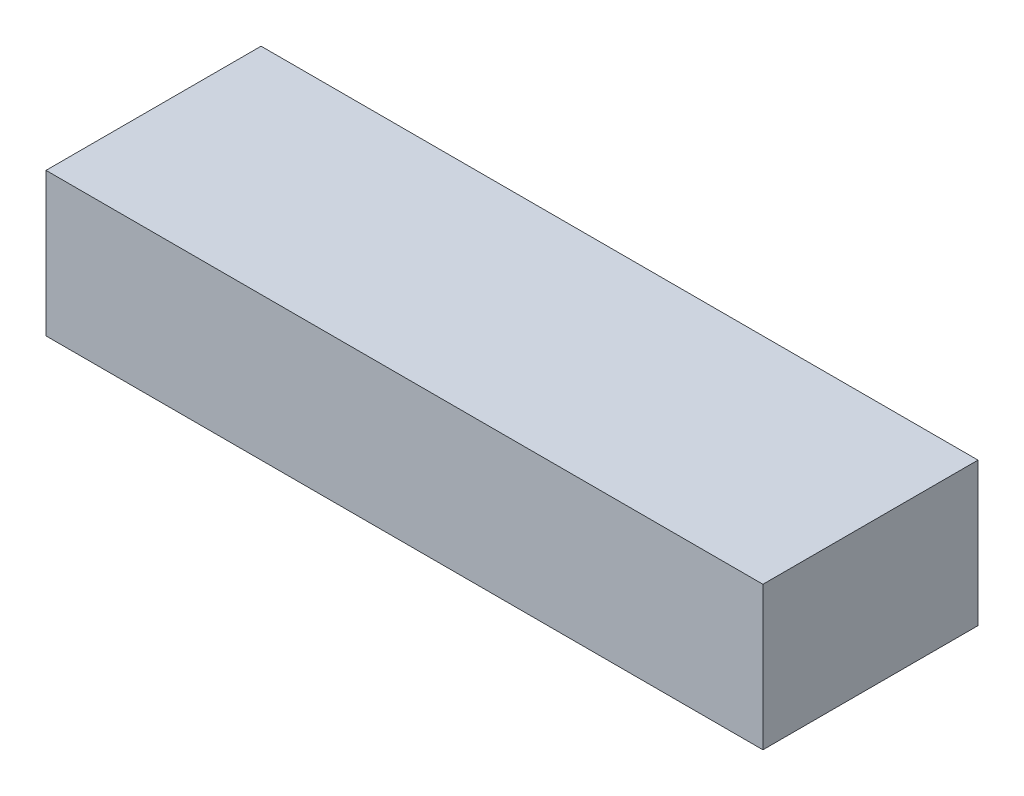
ISO-10303-21;
HEADER;
FILE_DESCRIPTION(('STEP AP214'),'2;1');
FILE_NAME('part.step','',(''),(''),'','','');
FILE_SCHEMA(('AUTOMOTIVE_DESIGN { 1 0 10303 214 1 1 1 1 }'));
ENDSEC;
DATA;
#1=APPLICATION_CONTEXT('core data for automotive mechanical design processes');
#2=APPLICATION_PROTOCOL_DEFINITION('international standard','automotive_design',2000,#1);
#3=PRODUCT_CONTEXT('',#1,'mechanical');
#4=PRODUCT('Part','Part','',(#3));
#5=PRODUCT_RELATED_PRODUCT_CATEGORY('part','',(#4));
#6=PRODUCT_DEFINITION_FORMATION('','',#4);
#7=PRODUCT_DEFINITION_CONTEXT('part definition',#1,'design');
#8=PRODUCT_DEFINITION('design','',#6,#7);
#9=PRODUCT_DEFINITION_SHAPE('','',#8);
#10=(LENGTH_UNIT() NAMED_UNIT(*) SI_UNIT(.MILLI.,.METRE.));
#11=(NAMED_UNIT(*) PLANE_ANGLE_UNIT() SI_UNIT($,.RADIAN.));
#12=(NAMED_UNIT(*) SI_UNIT($,.STERADIAN.) SOLID_ANGLE_UNIT());
#13=UNCERTAINTY_MEASURE_WITH_UNIT(LENGTH_MEASURE(1.E-05),#10,'distance_accuracy_value','');
#14=(GEOMETRIC_REPRESENTATION_CONTEXT(3) GLOBAL_UNCERTAINTY_ASSIGNED_CONTEXT((#13)) GLOBAL_UNIT_ASSIGNED_CONTEXT((#10,
#11,#12)) REPRESENTATION_CONTEXT('',''));
#15=CARTESIAN_POINT('',(0.,0.,0.));
#16=DIRECTION('',(0.,0.,1.));
#17=DIRECTION('',(1.,0.,0.));
#18=AXIS2_PLACEMENT_3D('',#15,#16,#17);
#19=CARTESIAN_POINT('',(-63.5,25.4,-19.05));
#20=DIRECTION('',(1.,0.,0.));
#21=DIRECTION('',(0.,0.,-1.));
#22=AXIS2_PLACEMENT_3D('',#19,#20,#21);
#23=PLANE('',#22);
#24=DIRECTION('',(0.,0.,1.));
#25=VECTOR('',#24,1.);
#26=CARTESIAN_POINT('',(-63.5,0.,-19.05));
#27=LINE('',#26,#25);
#28=CARTESIAN_POINT('',(-63.5,0.,-19.05));
#29=VERTEX_POINT('',#28);
#30=CARTESIAN_POINT('',(-63.5,0.,19.05));
#31=VERTEX_POINT('',#30);
#32=EDGE_CURVE('E98',#29,#31,#27,.T.);
#33=ORIENTED_EDGE('',*,*,#32,.T.);
#34=DIRECTION('',(0.,-1.,0.));
#35=VECTOR('',#34,1.);
#36=CARTESIAN_POINT('',(-63.5,25.4,19.05));
#37=LINE('',#36,#35);
#38=CARTESIAN_POINT('',(-63.5,25.4,19.05));
#39=VERTEX_POINT('',#38);
#40=EDGE_CURVE('E11',#39,#31,#37,.T.);
#41=ORIENTED_EDGE('',*,*,#40,.F.);
#42=DIRECTION('',(0.,0.,1.));
#43=VECTOR('',#42,1.);
#44=CARTESIAN_POINT('',(-63.5,25.4,-19.05));
#45=LINE('',#44,#43);
#46=CARTESIAN_POINT('',(-63.5,25.4,-19.05));
#47=VERTEX_POINT('',#46);
#48=EDGE_CURVE('E86',#47,#39,#45,.T.);
#49=ORIENTED_EDGE('',*,*,#48,.F.);
#50=DIRECTION('',(0.,-1.,0.));
#51=VECTOR('',#50,1.);
#52=CARTESIAN_POINT('',(-63.5,25.4,-19.05));
#53=LINE('',#52,#51);
#54=EDGE_CURVE('E94',#47,#29,#53,.T.);
#55=ORIENTED_EDGE('',*,*,#54,.T.);
#56=EDGE_LOOP('',(#33,#41,#49,#55));
#57=FACE_BOUND('',#56,.T.);
#58=ADVANCED_FACE('F35',(#57),#23,.F.);
#59=CARTESIAN_POINT('',(-63.5,25.4,19.05));
#60=DIRECTION('',(0.,0.,-1.));
#61=DIRECTION('',(-1.,0.,0.));
#62=AXIS2_PLACEMENT_3D('',#59,#60,#61);
#63=PLANE('',#62);
#64=DIRECTION('',(1.,0.,0.));
#65=VECTOR('',#64,1.);
#66=CARTESIAN_POINT('',(-63.5,0.,19.05));
#67=LINE('',#66,#65);
#68=CARTESIAN_POINT('',(63.5,0.,19.05));
#69=VERTEX_POINT('',#68);
#70=EDGE_CURVE('E90',#31,#69,#67,.T.);
#71=ORIENTED_EDGE('',*,*,#70,.T.);
#72=DIRECTION('',(0.,-1.,0.));
#73=VECTOR('',#72,1.);
#74=CARTESIAN_POINT('',(63.5,25.4,19.05));
#75=LINE('',#74,#73);
#76=CARTESIAN_POINT('',(63.5,25.4,19.05));
#77=VERTEX_POINT('',#76);
#78=EDGE_CURVE('E43',#77,#69,#75,.T.);
#79=ORIENTED_EDGE('',*,*,#78,.F.);
#80=DIRECTION('',(1.,0.,0.));
#81=VECTOR('',#80,1.);
#82=CARTESIAN_POINT('',(-63.5,25.4,19.05));
#83=LINE('',#82,#81);
#84=EDGE_CURVE('E81',#39,#77,#83,.T.);
#85=ORIENTED_EDGE('',*,*,#84,.F.);
#86=ORIENTED_EDGE('',*,*,#40,.T.);
#87=EDGE_LOOP('',(#71,#79,#85,#86));
#88=FACE_BOUND('',#87,.T.);
#89=ADVANCED_FACE('F89',(#88),#63,.F.);
#90=CARTESIAN_POINT('',(63.5,25.4,-19.05));
#91=DIRECTION('',(-1.,0.,0.));
#92=DIRECTION('',(0.,0.,1.));
#93=AXIS2_PLACEMENT_3D('',#90,#91,#92);
#94=PLANE('',#93);
#95=DIRECTION('',(0.,0.,-1.));
#96=VECTOR('',#95,1.);
#97=CARTESIAN_POINT('',(63.5,0.,-19.05));
#98=LINE('',#97,#96);
#99=CARTESIAN_POINT('',(63.5,0.,-19.05));
#100=VERTEX_POINT('',#99);
#101=EDGE_CURVE('E68',#69,#100,#98,.T.);
#102=ORIENTED_EDGE('',*,*,#101,.T.);
#103=DIRECTION('',(0.,-1.,0.));
#104=VECTOR('',#103,1.);
#105=CARTESIAN_POINT('',(63.5,25.4,-19.05));
#106=LINE('',#105,#104);
#107=CARTESIAN_POINT('',(63.5,25.4,-19.05));
#108=VERTEX_POINT('',#107);
#109=EDGE_CURVE('E91',#108,#100,#106,.T.);
#110=ORIENTED_EDGE('',*,*,#109,.F.);
#111=DIRECTION('',(0.,0.,-1.));
#112=VECTOR('',#111,1.);
#113=CARTESIAN_POINT('',(63.5,25.4,-19.05));
#114=LINE('',#113,#112);
#115=EDGE_CURVE('E84',#77,#108,#114,.T.);
#116=ORIENTED_EDGE('',*,*,#115,.F.);
#117=ORIENTED_EDGE('',*,*,#78,.T.);
#118=EDGE_LOOP('',(#102,#110,#116,#117));
#119=FACE_BOUND('',#118,.T.);
#120=ADVANCED_FACE('F92',(#119),#94,.F.);
#121=CARTESIAN_POINT('',(-63.5,25.4,-19.05));
#122=DIRECTION('',(0.,0.,1.));
#123=DIRECTION('',(1.,0.,0.));
#124=AXIS2_PLACEMENT_3D('',#121,#122,#123);
#125=PLANE('',#124);
#126=DIRECTION('',(-1.,0.,0.));
#127=VECTOR('',#126,1.);
#128=CARTESIAN_POINT('',(-63.5,0.,-19.05));
#129=LINE('',#128,#127);
#130=EDGE_CURVE('E74',#100,#29,#129,.T.);
#131=ORIENTED_EDGE('',*,*,#130,.T.);
#132=ORIENTED_EDGE('',*,*,#54,.F.);
#133=DIRECTION('',(-1.,0.,0.));
#134=VECTOR('',#133,1.);
#135=CARTESIAN_POINT('',(-63.5,25.4,-19.05));
#136=LINE('',#135,#134);
#137=EDGE_CURVE('E51',#108,#47,#136,.T.);
#138=ORIENTED_EDGE('',*,*,#137,.F.);
#139=ORIENTED_EDGE('',*,*,#109,.T.);
#140=EDGE_LOOP('',(#131,#132,#138,#139));
#141=FACE_BOUND('',#140,.T.);
#142=ADVANCED_FACE('F105',(#141),#125,.F.);
#143=CARTESIAN_POINT('',(-63.5,25.4,19.05));
#144=DIRECTION('',(0.,1.,0.));
#145=DIRECTION('',(0.,0.,1.));
#146=AXIS2_PLACEMENT_3D('',#143,#144,#145);
#147=PLANE('',#146);
#148=ORIENTED_EDGE('',*,*,#48,.T.);
#149=ORIENTED_EDGE('',*,*,#84,.T.);
#150=ORIENTED_EDGE('',*,*,#115,.T.);
#151=ORIENTED_EDGE('',*,*,#137,.T.);
#152=EDGE_LOOP('',(#148,#149,#150,#151));
#153=FACE_BOUND('',#152,.T.);
#154=ADVANCED_FACE('F82',(#153),#147,.T.);
#155=CARTESIAN_POINT('',(-63.5,0.,19.05));
#156=DIRECTION('',(0.,1.,0.));
#157=DIRECTION('',(0.,0.,1.));
#158=AXIS2_PLACEMENT_3D('',#155,#156,#157);
#159=PLANE('',#158);
#160=ORIENTED_EDGE('',*,*,#32,.F.);
#161=ORIENTED_EDGE('',*,*,#130,.F.);
#162=ORIENTED_EDGE('',*,*,#101,.F.);
#163=ORIENTED_EDGE('',*,*,#70,.F.);
#164=EDGE_LOOP('',(#160,#161,#162,#163));
#165=FACE_BOUND('',#164,.T.);
#166=ADVANCED_FACE('F108',(#165),#159,.F.);
#167=CLOSED_SHELL('',(#58,#89,#120,#142,#154,#166));
#168=MANIFOLD_SOLID_BREP('B2',#167);
#169=ADVANCED_BREP_SHAPE_REPRESENTATION('',(#18,#168),#14);
#170=SHAPE_DEFINITION_REPRESENTATION(#9,#169);
ENDSEC;
END-ISO-10303-21;
